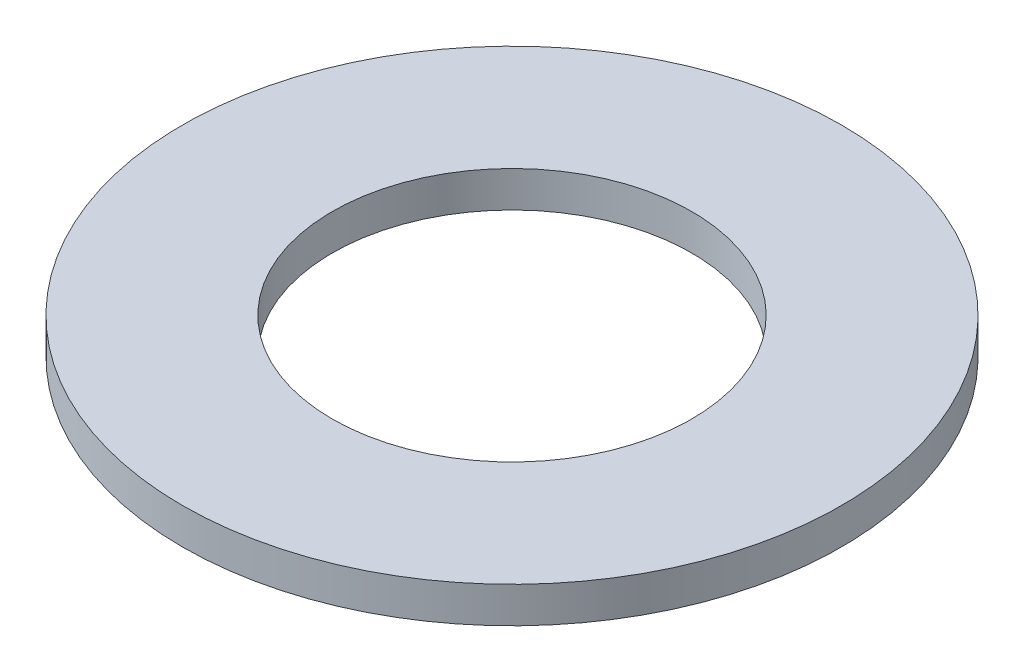
ISO-10303-21;
HEADER;
FILE_DESCRIPTION(('STEP AP214'),'2;1');
FILE_NAME('part.step','',(''),(''),'','','');
FILE_SCHEMA(('AUTOMOTIVE_DESIGN { 1 0 10303 214 1 1 1 1 }'));
ENDSEC;
DATA;
#1=APPLICATION_CONTEXT('core data for automotive mechanical design processes');
#2=APPLICATION_PROTOCOL_DEFINITION('international standard','automotive_design',2000,#1);
#3=PRODUCT_CONTEXT('',#1,'mechanical');
#4=PRODUCT('Part','Part','',(#3));
#5=PRODUCT_RELATED_PRODUCT_CATEGORY('part','',(#4));
#6=PRODUCT_DEFINITION_FORMATION('','',#4);
#7=PRODUCT_DEFINITION_CONTEXT('part definition',#1,'design');
#8=PRODUCT_DEFINITION('design','',#6,#7);
#9=PRODUCT_DEFINITION_SHAPE('','',#8);
#10=(LENGTH_UNIT() NAMED_UNIT(*) SI_UNIT(.MILLI.,.METRE.));
#11=(NAMED_UNIT(*) PLANE_ANGLE_UNIT() SI_UNIT($,.RADIAN.));
#12=(NAMED_UNIT(*) SI_UNIT($,.STERADIAN.) SOLID_ANGLE_UNIT());
#13=UNCERTAINTY_MEASURE_WITH_UNIT(LENGTH_MEASURE(1.E-05),#10,'distance_accuracy_value','');
#14=(GEOMETRIC_REPRESENTATION_CONTEXT(3) GLOBAL_UNCERTAINTY_ASSIGNED_CONTEXT((#13)) GLOBAL_UNIT_ASSIGNED_CONTEXT((#10,
#11,#12)) REPRESENTATION_CONTEXT('',''));
#15=CARTESIAN_POINT('',(0.,0.,0.));
#16=DIRECTION('',(0.,0.,1.));
#17=DIRECTION('',(1.,0.,0.));
#18=AXIS2_PLACEMENT_3D('',#15,#16,#17);
#19=CARTESIAN_POINT('',(0.,6.,0.));
#20=DIRECTION('',(0.,-1.,0.));
#21=DIRECTION('',(0.,0.,-1.));
#22=AXIS2_PLACEMENT_3D('',#19,#20,#21);
#23=CYLINDRICAL_SURFACE('',#22,55.);
#24=CARTESIAN_POINT('',(0.,6.,0.));
#25=DIRECTION('',(0.,1.,0.));
#26=DIRECTION('',(0.,0.,1.));
#27=AXIS2_PLACEMENT_3D('',#24,#25,#26);
#28=CIRCLE('',#27,55.);
#29=CARTESIAN_POINT('',(0.,6.,55.));
#30=VERTEX_POINT('',#29);
#31=EDGE_CURVE('E10',#30,#30,#28,.T.);
#32=ORIENTED_EDGE('',*,*,#31,.F.);
#33=EDGE_LOOP('',(#32));
#34=FACE_BOUND('',#33,.T.);
#35=CARTESIAN_POINT('',(0.,0.,0.));
#36=DIRECTION('',(0.,1.,0.));
#37=DIRECTION('',(0.,0.,1.));
#38=AXIS2_PLACEMENT_3D('',#35,#36,#37);
#39=CIRCLE('',#38,55.);
#40=CARTESIAN_POINT('',(0.,0.,55.));
#41=VERTEX_POINT('',#40);
#42=EDGE_CURVE('E37',#41,#41,#39,.T.);
#43=ORIENTED_EDGE('',*,*,#42,.T.);
#44=EDGE_LOOP('',(#43));
#45=FACE_BOUND('',#44,.T.);
#46=ADVANCED_FACE('F40',(#34,#45),#23,.T.);
#47=CARTESIAN_POINT('',(0.,6.,0.));
#48=DIRECTION('',(0.,1.,0.));
#49=DIRECTION('',(0.,0.,1.));
#50=AXIS2_PLACEMENT_3D('',#47,#48,#49);
#51=PLANE('',#50);
#52=CARTESIAN_POINT('',(0.,6.,0.));
#53=DIRECTION('',(0.,1.,0.));
#54=DIRECTION('',(0.,0.,1.));
#55=AXIS2_PLACEMENT_3D('',#52,#53,#54);
#56=CIRCLE('',#55,30.);
#57=CARTESIAN_POINT('',(0.,6.,30.));
#58=VERTEX_POINT('',#57);
#59=EDGE_CURVE('E50',#58,#58,#56,.T.);
#60=ORIENTED_EDGE('',*,*,#59,.F.);
#61=EDGE_LOOP('',(#60));
#62=FACE_BOUND('',#61,.T.);
#63=ORIENTED_EDGE('',*,*,#31,.T.);
#64=EDGE_LOOP('',(#63));
#65=FACE_BOUND('',#64,.T.);
#66=ADVANCED_FACE('F59',(#62,#65),#51,.T.);
#67=CARTESIAN_POINT('',(0.,0.,0.));
#68=DIRECTION('',(0.,1.,0.));
#69=DIRECTION('',(0.,0.,1.));
#70=AXIS2_PLACEMENT_3D('',#67,#68,#69);
#71=PLANE('',#70);
#72=CARTESIAN_POINT('',(0.,0.,0.));
#73=DIRECTION('',(0.,1.,0.));
#74=DIRECTION('',(0.,0.,1.));
#75=AXIS2_PLACEMENT_3D('',#72,#73,#74);
#76=CIRCLE('',#75,30.);
#77=CARTESIAN_POINT('',(0.,0.,30.));
#78=VERTEX_POINT('',#77);
#79=EDGE_CURVE('E47',#78,#78,#76,.T.);
#80=ORIENTED_EDGE('',*,*,#79,.T.);
#81=EDGE_LOOP('',(#80));
#82=FACE_BOUND('',#81,.T.);
#83=ORIENTED_EDGE('',*,*,#42,.F.);
#84=EDGE_LOOP('',(#83));
#85=FACE_BOUND('',#84,.T.);
#86=ADVANCED_FACE('F58',(#82,#85),#71,.F.);
#87=CARTESIAN_POINT('',(0.,6.,0.));
#88=DIRECTION('',(0.,-1.,0.));
#89=DIRECTION('',(0.,0.,-1.));
#90=AXIS2_PLACEMENT_3D('',#87,#88,#89);
#91=CYLINDRICAL_SURFACE('',#90,30.);
#92=ORIENTED_EDGE('',*,*,#59,.T.);
#93=EDGE_LOOP('',(#92));
#94=FACE_BOUND('',#93,.T.);
#95=ORIENTED_EDGE('',*,*,#79,.F.);
#96=EDGE_LOOP('',(#95));
#97=FACE_BOUND('',#96,.T.);
#98=ADVANCED_FACE('F54',(#94,#97),#91,.F.);
#99=CLOSED_SHELL('',(#46,#66,#86,#98));
#100=MANIFOLD_SOLID_BREP('B2',#99);
#101=ADVANCED_BREP_SHAPE_REPRESENTATION('',(#18,#100),#14);
#102=SHAPE_DEFINITION_REPRESENTATION(#9,#101);
ENDSEC;
END-ISO-10303-21;
